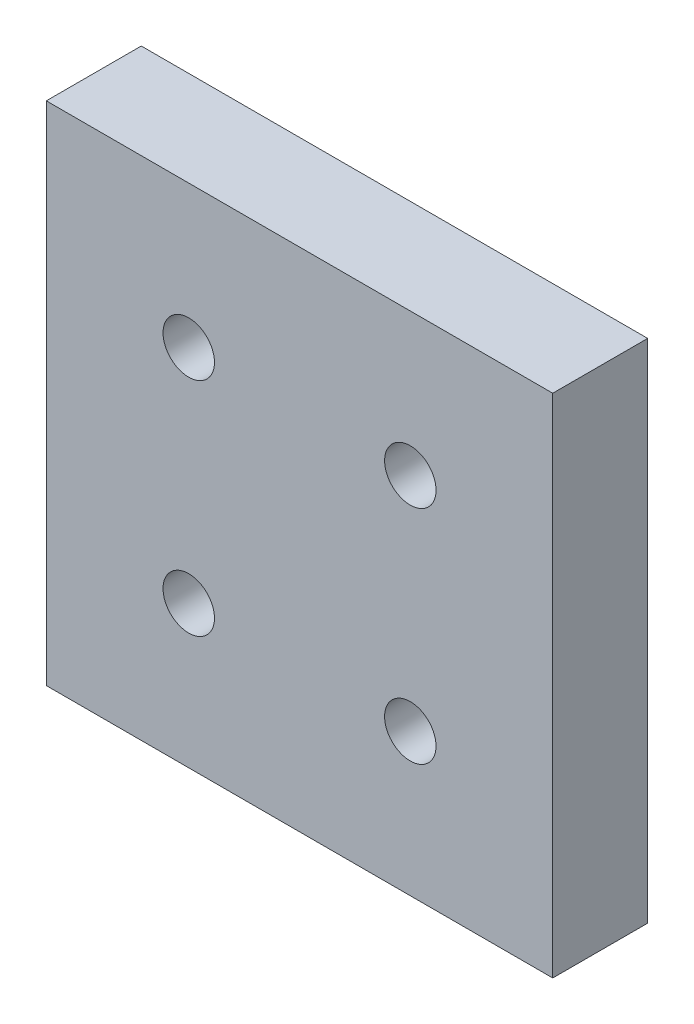
ISO-10303-21;
HEADER;
FILE_DESCRIPTION(('STEP AP214'),'2;1');
FILE_NAME('part.step','',(''),(''),'','','');
FILE_SCHEMA(('AUTOMOTIVE_DESIGN { 1 0 10303 214 1 1 1 1 }'));
ENDSEC;
DATA;
#1=APPLICATION_CONTEXT('core data for automotive mechanical design processes');
#2=APPLICATION_PROTOCOL_DEFINITION('international standard','automotive_design',2000,#1);
#3=PRODUCT_CONTEXT('',#1,'mechanical');
#4=PRODUCT('Part','Part','',(#3));
#5=PRODUCT_RELATED_PRODUCT_CATEGORY('part','',(#4));
#6=PRODUCT_DEFINITION_FORMATION('','',#4);
#7=PRODUCT_DEFINITION_CONTEXT('part definition',#1,'design');
#8=PRODUCT_DEFINITION('design','',#6,#7);
#9=PRODUCT_DEFINITION_SHAPE('','',#8);
#10=(LENGTH_UNIT() NAMED_UNIT(*) SI_UNIT(.MILLI.,.METRE.));
#11=(NAMED_UNIT(*) PLANE_ANGLE_UNIT() SI_UNIT($,.RADIAN.));
#12=(NAMED_UNIT(*) SI_UNIT($,.STERADIAN.) SOLID_ANGLE_UNIT());
#13=UNCERTAINTY_MEASURE_WITH_UNIT(LENGTH_MEASURE(1.E-05),#10,'distance_accuracy_value','');
#14=(GEOMETRIC_REPRESENTATION_CONTEXT(3) GLOBAL_UNCERTAINTY_ASSIGNED_CONTEXT((#13)) GLOBAL_UNIT_ASSIGNED_CONTEXT((#10,
#11,#12)) REPRESENTATION_CONTEXT('',''));
#15=CARTESIAN_POINT('',(0.,0.,0.));
#16=DIRECTION('',(0.,0.,1.));
#17=DIRECTION('',(1.,0.,0.));
#18=AXIS2_PLACEMENT_3D('',#15,#16,#17);
#19=CARTESIAN_POINT('',(-101.6,101.6,38.1));
#20=DIRECTION('',(1.,0.,0.));
#21=DIRECTION('',(0.,1.,0.));
#22=AXIS2_PLACEMENT_3D('',#19,#20,#21);
#23=PLANE('',#22);
#24=DIRECTION('',(0.,-1.,0.));
#25=VECTOR('',#24,1.);
#26=CARTESIAN_POINT('',(-101.6,101.6,0.));
#27=LINE('',#26,#25);
#28=CARTESIAN_POINT('',(-101.6,101.6,0.));
#29=VERTEX_POINT('',#28);
#30=CARTESIAN_POINT('',(-101.6,-101.6,0.));
#31=VERTEX_POINT('',#30);
#32=EDGE_CURVE('E95',#29,#31,#27,.T.);
#33=ORIENTED_EDGE('',*,*,#32,.T.);
#34=DIRECTION('',(0.,0.,-1.));
#35=VECTOR('',#34,1.);
#36=CARTESIAN_POINT('',(-101.6,-101.6,38.1));
#37=LINE('',#36,#35);
#38=CARTESIAN_POINT('',(-101.6,-101.6,38.1));
#39=VERTEX_POINT('',#38);
#40=EDGE_CURVE('E11',#39,#31,#37,.T.);
#41=ORIENTED_EDGE('',*,*,#40,.F.);
#42=DIRECTION('',(0.,-1.,0.));
#43=VECTOR('',#42,1.);
#44=CARTESIAN_POINT('',(-101.6,101.6,38.1));
#45=LINE('',#44,#43);
#46=CARTESIAN_POINT('',(-101.6,101.6,38.1));
#47=VERTEX_POINT('',#46);
#48=EDGE_CURVE('E83',#47,#39,#45,.T.);
#49=ORIENTED_EDGE('',*,*,#48,.F.);
#50=DIRECTION('',(0.,0.,-1.));
#51=VECTOR('',#50,1.);
#52=CARTESIAN_POINT('',(-101.6,101.6,38.1));
#53=LINE('',#52,#51);
#54=EDGE_CURVE('E91',#47,#29,#53,.T.);
#55=ORIENTED_EDGE('',*,*,#54,.T.);
#56=EDGE_LOOP('',(#33,#41,#49,#55));
#57=FACE_BOUND('',#56,.T.);
#58=ADVANCED_FACE('F32',(#57),#23,.F.);
#59=CARTESIAN_POINT('',(-101.6,-101.6,38.1));
#60=DIRECTION('',(0.,1.,0.));
#61=DIRECTION('',(-1.,0.,0.));
#62=AXIS2_PLACEMENT_3D('',#59,#60,#61);
#63=PLANE('',#62);
#64=DIRECTION('',(1.,0.,0.));
#65=VECTOR('',#64,1.);
#66=CARTESIAN_POINT('',(-101.6,-101.6,0.));
#67=LINE('',#66,#65);
#68=CARTESIAN_POINT('',(101.6,-101.6,0.));
#69=VERTEX_POINT('',#68);
#70=EDGE_CURVE('E87',#31,#69,#67,.T.);
#71=ORIENTED_EDGE('',*,*,#70,.T.);
#72=DIRECTION('',(0.,0.,-1.));
#73=VECTOR('',#72,1.);
#74=CARTESIAN_POINT('',(101.6,-101.6,38.1));
#75=LINE('',#74,#73);
#76=CARTESIAN_POINT('',(101.6,-101.6,38.1));
#77=VERTEX_POINT('',#76);
#78=EDGE_CURVE('E40',#77,#69,#75,.T.);
#79=ORIENTED_EDGE('',*,*,#78,.F.);
#80=DIRECTION('',(1.,0.,0.));
#81=VECTOR('',#80,1.);
#82=CARTESIAN_POINT('',(-101.6,-101.6,38.1));
#83=LINE('',#82,#81);
#84=EDGE_CURVE('E78',#39,#77,#83,.T.);
#85=ORIENTED_EDGE('',*,*,#84,.F.);
#86=ORIENTED_EDGE('',*,*,#40,.T.);
#87=EDGE_LOOP('',(#71,#79,#85,#86));
#88=FACE_BOUND('',#87,.T.);
#89=ADVANCED_FACE('F86',(#88),#63,.F.);
#90=CARTESIAN_POINT('',(101.6,101.6,38.1));
#91=DIRECTION('',(-1.,0.,0.));
#92=DIRECTION('',(0.,-1.,0.));
#93=AXIS2_PLACEMENT_3D('',#90,#91,#92);
#94=PLANE('',#93);
#95=DIRECTION('',(0.,1.,0.));
#96=VECTOR('',#95,1.);
#97=CARTESIAN_POINT('',(101.6,101.6,0.));
#98=LINE('',#97,#96);
#99=CARTESIAN_POINT('',(101.6,101.6,0.));
#100=VERTEX_POINT('',#99);
#101=EDGE_CURVE('E65',#69,#100,#98,.T.);
#102=ORIENTED_EDGE('',*,*,#101,.T.);
#103=DIRECTION('',(0.,0.,-1.));
#104=VECTOR('',#103,1.);
#105=CARTESIAN_POINT('',(101.6,101.6,38.1));
#106=LINE('',#105,#104);
#107=CARTESIAN_POINT('',(101.6,101.6,38.1));
#108=VERTEX_POINT('',#107);
#109=EDGE_CURVE('E88',#108,#100,#106,.T.);
#110=ORIENTED_EDGE('',*,*,#109,.F.);
#111=DIRECTION('',(0.,1.,0.));
#112=VECTOR('',#111,1.);
#113=CARTESIAN_POINT('',(101.6,101.6,38.1));
#114=LINE('',#113,#112);
#115=EDGE_CURVE('E81',#77,#108,#114,.T.);
#116=ORIENTED_EDGE('',*,*,#115,.F.);
#117=ORIENTED_EDGE('',*,*,#78,.T.);
#118=EDGE_LOOP('',(#102,#110,#116,#117));
#119=FACE_BOUND('',#118,.T.);
#120=ADVANCED_FACE('F89',(#119),#94,.F.);
#121=CARTESIAN_POINT('',(-101.6,101.6,38.1));
#122=DIRECTION('',(0.,-1.,0.));
#123=DIRECTION('',(0.,0.,-1.));
#124=AXIS2_PLACEMENT_3D('',#121,#122,#123);
#125=PLANE('',#124);
#126=DIRECTION('',(-1.,0.,0.));
#127=VECTOR('',#126,1.);
#128=CARTESIAN_POINT('',(-101.6,101.6,0.));
#129=LINE('',#128,#127);
#130=EDGE_CURVE('E71',#100,#29,#129,.T.);
#131=ORIENTED_EDGE('',*,*,#130,.T.);
#132=ORIENTED_EDGE('',*,*,#54,.F.);
#133=DIRECTION('',(-1.,0.,0.));
#134=VECTOR('',#133,1.);
#135=CARTESIAN_POINT('',(-101.6,101.6,38.1));
#136=LINE('',#135,#134);
#137=EDGE_CURVE('E48',#108,#47,#136,.T.);
#138=ORIENTED_EDGE('',*,*,#137,.F.);
#139=ORIENTED_EDGE('',*,*,#109,.T.);
#140=EDGE_LOOP('',(#131,#132,#138,#139));
#141=FACE_BOUND('',#140,.T.);
#142=ADVANCED_FACE('F103',(#141),#125,.F.);
#143=CARTESIAN_POINT('',(-101.6,-101.6,38.1));
#144=DIRECTION('',(0.,0.,1.));
#145=DIRECTION('',(1.,0.,0.));
#146=AXIS2_PLACEMENT_3D('',#143,#144,#145);
#147=PLANE('',#146);
#148=CARTESIAN_POINT('',(44.45,-44.45,38.1));
#149=DIRECTION('',(0.,0.,1.));
#150=DIRECTION('',(1.,0.,0.));
#151=AXIS2_PLACEMENT_3D('',#148,#149,#150);
#152=CIRCLE('',#151,10.31875);
#153=CARTESIAN_POINT('',(54.76875,-44.45,38.1));
#154=VERTEX_POINT('',#153);
#155=EDGE_CURVE('E153',#154,#154,#152,.T.);
#156=ORIENTED_EDGE('',*,*,#155,.F.);
#157=EDGE_LOOP('',(#156));
#158=FACE_BOUND('',#157,.T.);
#159=CARTESIAN_POINT('',(-44.45,-44.45,38.1));
#160=DIRECTION('',(0.,0.,1.));
#161=DIRECTION('',(1.,0.,0.));
#162=AXIS2_PLACEMENT_3D('',#159,#160,#161);
#163=CIRCLE('',#162,10.31875);
#164=CARTESIAN_POINT('',(-34.13125,-44.45,38.1));
#165=VERTEX_POINT('',#164);
#166=EDGE_CURVE('E141',#165,#165,#163,.T.);
#167=ORIENTED_EDGE('',*,*,#166,.F.);
#168=EDGE_LOOP('',(#167));
#169=FACE_BOUND('',#168,.T.);
#170=CARTESIAN_POINT('',(-44.45,44.45,38.1));
#171=DIRECTION('',(0.,0.,1.));
#172=DIRECTION('',(1.,0.,0.));
#173=AXIS2_PLACEMENT_3D('',#170,#171,#172);
#174=CIRCLE('',#173,10.31875);
#175=CARTESIAN_POINT('',(-34.13125,44.45,38.1));
#176=VERTEX_POINT('',#175);
#177=EDGE_CURVE('E129',#176,#176,#174,.T.);
#178=ORIENTED_EDGE('',*,*,#177,.F.);
#179=EDGE_LOOP('',(#178));
#180=FACE_BOUND('',#179,.T.);
#181=CARTESIAN_POINT('',(44.45,44.45,38.1));
#182=DIRECTION('',(0.,0.,1.));
#183=DIRECTION('',(1.,0.,0.));
#184=AXIS2_PLACEMENT_3D('',#181,#182,#183);
#185=CIRCLE('',#184,10.31875);
#186=CARTESIAN_POINT('',(54.76875,44.45,38.1));
#187=VERTEX_POINT('',#186);
#188=EDGE_CURVE('E117',#187,#187,#185,.T.);
#189=ORIENTED_EDGE('',*,*,#188,.F.);
#190=EDGE_LOOP('',(#189));
#191=FACE_BOUND('',#190,.T.);
#192=ORIENTED_EDGE('',*,*,#48,.T.);
#193=ORIENTED_EDGE('',*,*,#84,.T.);
#194=ORIENTED_EDGE('',*,*,#115,.T.);
#195=ORIENTED_EDGE('',*,*,#137,.T.);
#196=EDGE_LOOP('',(#192,#193,#194,#195));
#197=FACE_BOUND('',#196,.T.);
#198=ADVANCED_FACE('F79',(#158,#169,#180,#191,#197),#147,.T.);
#199=CARTESIAN_POINT('',(-101.6,-101.6,0.));
#200=DIRECTION('',(0.,0.,1.));
#201=DIRECTION('',(1.,0.,0.));
#202=AXIS2_PLACEMENT_3D('',#199,#200,#201);
#203=PLANE('',#202);
#204=CARTESIAN_POINT('',(44.45,-44.45,0.));
#205=DIRECTION('',(0.,0.,1.));
#206=DIRECTION('',(1.,0.,0.));
#207=AXIS2_PLACEMENT_3D('',#204,#205,#206);
#208=CIRCLE('',#207,6.54811999999999);
#209=CARTESIAN_POINT('',(50.99812,-44.45,0.));
#210=VERTEX_POINT('',#209);
#211=EDGE_CURVE('E144',#210,#210,#208,.T.);
#212=ORIENTED_EDGE('',*,*,#211,.T.);
#213=EDGE_LOOP('',(#212));
#214=FACE_BOUND('',#213,.T.);
#215=CARTESIAN_POINT('',(-44.45,-44.45,0.));
#216=DIRECTION('',(0.,0.,1.));
#217=DIRECTION('',(1.,0.,0.));
#218=AXIS2_PLACEMENT_3D('',#215,#216,#217);
#219=CIRCLE('',#218,6.54811999999999);
#220=CARTESIAN_POINT('',(-37.90188,-44.45,0.));
#221=VERTEX_POINT('',#220);
#222=EDGE_CURVE('E132',#221,#221,#219,.T.);
#223=ORIENTED_EDGE('',*,*,#222,.T.);
#224=EDGE_LOOP('',(#223));
#225=FACE_BOUND('',#224,.T.);
#226=CARTESIAN_POINT('',(-44.45,44.45,0.));
#227=DIRECTION('',(0.,0.,1.));
#228=DIRECTION('',(1.,0.,0.));
#229=AXIS2_PLACEMENT_3D('',#226,#227,#228);
#230=CIRCLE('',#229,6.54811999999999);
#231=CARTESIAN_POINT('',(-37.90188,44.45,0.));
#232=VERTEX_POINT('',#231);
#233=EDGE_CURVE('E120',#232,#232,#230,.T.);
#234=ORIENTED_EDGE('',*,*,#233,.T.);
#235=EDGE_LOOP('',(#234));
#236=FACE_BOUND('',#235,.T.);
#237=CARTESIAN_POINT('',(44.45,44.45,0.));
#238=DIRECTION('',(0.,0.,1.));
#239=DIRECTION('',(1.,0.,0.));
#240=AXIS2_PLACEMENT_3D('',#237,#238,#239);
#241=CIRCLE('',#240,6.54811999999999);
#242=CARTESIAN_POINT('',(50.99812,44.45,0.));
#243=VERTEX_POINT('',#242);
#244=EDGE_CURVE('E98',#243,#243,#241,.T.);
#245=ORIENTED_EDGE('',*,*,#244,.T.);
#246=EDGE_LOOP('',(#245));
#247=FACE_BOUND('',#246,.T.);
#248=ORIENTED_EDGE('',*,*,#32,.F.);
#249=ORIENTED_EDGE('',*,*,#130,.F.);
#250=ORIENTED_EDGE('',*,*,#101,.F.);
#251=ORIENTED_EDGE('',*,*,#70,.F.);
#252=EDGE_LOOP('',(#248,#249,#250,#251));
#253=FACE_BOUND('',#252,.T.);
#254=ADVANCED_FACE('F106',(#214,#225,#236,#247,#253),#203,.F.);
#255=CARTESIAN_POINT('',(44.45,44.45,38.1));
#256=DIRECTION('',(0.,0.,1.));
#257=DIRECTION('',(1.,0.,0.));
#258=AXIS2_PLACEMENT_3D('',#255,#256,#257);
#259=CYLINDRICAL_SURFACE('',#258,6.54811999999999);
#260=ORIENTED_EDGE('',*,*,#244,.F.);
#261=EDGE_LOOP('',(#260));
#262=FACE_BOUND('',#261,.T.);
#263=CARTESIAN_POINT('',(44.45,44.45,19.05));
#264=DIRECTION('',(0.,0.,1.));
#265=DIRECTION('',(1.,0.,0.));
#266=AXIS2_PLACEMENT_3D('',#263,#264,#265);
#267=CIRCLE('',#266,6.54812);
#268=CARTESIAN_POINT('',(50.99812,44.45,19.05));
#269=VERTEX_POINT('',#268);
#270=EDGE_CURVE('E111',#269,#269,#267,.T.);
#271=ORIENTED_EDGE('',*,*,#270,.T.);
#272=EDGE_LOOP('',(#271));
#273=FACE_BOUND('',#272,.T.);
#274=ADVANCED_FACE('F181',(#262,#273),#259,.F.);
#275=CARTESIAN_POINT('',(50.99812,44.45,19.05));
#276=DIRECTION('',(0.,0.,-1.));
#277=DIRECTION('',(-1.,0.,0.));
#278=AXIS2_PLACEMENT_3D('',#275,#276,#277);
#279=PLANE('',#278);
#280=ORIENTED_EDGE('',*,*,#270,.F.);
#281=EDGE_LOOP('',(#280));
#282=FACE_BOUND('',#281,.T.);
#283=CARTESIAN_POINT('',(44.45,44.45,19.05));
#284=DIRECTION('',(0.,0.,1.));
#285=DIRECTION('',(1.,0.,0.));
#286=AXIS2_PLACEMENT_3D('',#283,#284,#285);
#287=CIRCLE('',#286,10.31875);
#288=CARTESIAN_POINT('',(54.76875,44.45,19.05));
#289=VERTEX_POINT('',#288);
#290=EDGE_CURVE('E114',#289,#289,#287,.T.);
#291=ORIENTED_EDGE('',*,*,#290,.T.);
#292=EDGE_LOOP('',(#291));
#293=FACE_BOUND('',#292,.T.);
#294=ADVANCED_FACE('F171',(#282,#293),#279,.F.);
#295=CARTESIAN_POINT('',(44.45,44.45,38.1));
#296=DIRECTION('',(0.,0.,1.));
#297=DIRECTION('',(1.,0.,0.));
#298=AXIS2_PLACEMENT_3D('',#295,#296,#297);
#299=CYLINDRICAL_SURFACE('',#298,10.31875);
#300=ORIENTED_EDGE('',*,*,#290,.F.);
#301=EDGE_LOOP('',(#300));
#302=FACE_BOUND('',#301,.T.);
#303=ORIENTED_EDGE('',*,*,#188,.T.);
#304=EDGE_LOOP('',(#303));
#305=FACE_BOUND('',#304,.T.);
#306=ADVANCED_FACE('F168',(#302,#305),#299,.F.);
#307=CARTESIAN_POINT('',(-44.45,44.45,38.1));
#308=DIRECTION('',(0.,0.,1.));
#309=DIRECTION('',(1.,0.,0.));
#310=AXIS2_PLACEMENT_3D('',#307,#308,#309);
#311=CYLINDRICAL_SURFACE('',#310,6.54811999999999);
#312=ORIENTED_EDGE('',*,*,#233,.F.);
#313=EDGE_LOOP('',(#312));
#314=FACE_BOUND('',#313,.T.);
#315=CARTESIAN_POINT('',(-44.45,44.45,19.05));
#316=DIRECTION('',(0.,0.,1.));
#317=DIRECTION('',(1.,0.,0.));
#318=AXIS2_PLACEMENT_3D('',#315,#316,#317);
#319=CIRCLE('',#318,6.54812);
#320=CARTESIAN_POINT('',(-37.90188,44.45,19.05));
#321=VERTEX_POINT('',#320);
#322=EDGE_CURVE('E123',#321,#321,#319,.T.);
#323=ORIENTED_EDGE('',*,*,#322,.T.);
#324=EDGE_LOOP('',(#323));
#325=FACE_BOUND('',#324,.T.);
#326=ADVANCED_FACE('F170',(#314,#325),#311,.F.);
#327=CARTESIAN_POINT('',(-37.90188,44.45,19.05));
#328=DIRECTION('',(0.,0.,-1.));
#329=DIRECTION('',(-1.,0.,0.));
#330=AXIS2_PLACEMENT_3D('',#327,#328,#329);
#331=PLANE('',#330);
#332=ORIENTED_EDGE('',*,*,#322,.F.);
#333=EDGE_LOOP('',(#332));
#334=FACE_BOUND('',#333,.T.);
#335=CARTESIAN_POINT('',(-44.45,44.45,19.05));
#336=DIRECTION('',(0.,0.,1.));
#337=DIRECTION('',(1.,0.,0.));
#338=AXIS2_PLACEMENT_3D('',#335,#336,#337);
#339=CIRCLE('',#338,10.31875);
#340=CARTESIAN_POINT('',(-34.13125,44.45,19.05));
#341=VERTEX_POINT('',#340);
#342=EDGE_CURVE('E126',#341,#341,#339,.T.);
#343=ORIENTED_EDGE('',*,*,#342,.T.);
#344=EDGE_LOOP('',(#343));
#345=FACE_BOUND('',#344,.T.);
#346=ADVANCED_FACE('F178',(#334,#345),#331,.F.);
#347=CARTESIAN_POINT('',(-44.45,44.45,38.1));
#348=DIRECTION('',(0.,0.,1.));
#349=DIRECTION('',(1.,0.,0.));
#350=AXIS2_PLACEMENT_3D('',#347,#348,#349);
#351=CYLINDRICAL_SURFACE('',#350,10.31875);
#352=ORIENTED_EDGE('',*,*,#342,.F.);
#353=EDGE_LOOP('',(#352));
#354=FACE_BOUND('',#353,.T.);
#355=ORIENTED_EDGE('',*,*,#177,.T.);
#356=EDGE_LOOP('',(#355));
#357=FACE_BOUND('',#356,.T.);
#358=ADVANCED_FACE('F233',(#354,#357),#351,.F.);
#359=CARTESIAN_POINT('',(-44.45,-44.45,38.1));
#360=DIRECTION('',(0.,0.,1.));
#361=DIRECTION('',(1.,0.,0.));
#362=AXIS2_PLACEMENT_3D('',#359,#360,#361);
#363=CYLINDRICAL_SURFACE('',#362,6.54811999999999);
#364=ORIENTED_EDGE('',*,*,#222,.F.);
#365=EDGE_LOOP('',(#364));
#366=FACE_BOUND('',#365,.T.);
#367=CARTESIAN_POINT('',(-44.45,-44.45,19.05));
#368=DIRECTION('',(0.,0.,1.));
#369=DIRECTION('',(1.,0.,0.));
#370=AXIS2_PLACEMENT_3D('',#367,#368,#369);
#371=CIRCLE('',#370,6.54812);
#372=CARTESIAN_POINT('',(-37.90188,-44.45,19.05));
#373=VERTEX_POINT('',#372);
#374=EDGE_CURVE('E135',#373,#373,#371,.T.);
#375=ORIENTED_EDGE('',*,*,#374,.T.);
#376=EDGE_LOOP('',(#375));
#377=FACE_BOUND('',#376,.T.);
#378=ADVANCED_FACE('F243',(#366,#377),#363,.F.);
#379=CARTESIAN_POINT('',(-37.90188,-44.45,19.05));
#380=DIRECTION('',(0.,0.,-1.));
#381=DIRECTION('',(-1.,0.,0.));
#382=AXIS2_PLACEMENT_3D('',#379,#380,#381);
#383=PLANE('',#382);
#384=ORIENTED_EDGE('',*,*,#374,.F.);
#385=EDGE_LOOP('',(#384));
#386=FACE_BOUND('',#385,.T.);
#387=CARTESIAN_POINT('',(-44.45,-44.45,19.05));
#388=DIRECTION('',(0.,0.,1.));
#389=DIRECTION('',(1.,0.,0.));
#390=AXIS2_PLACEMENT_3D('',#387,#388,#389);
#391=CIRCLE('',#390,10.31875);
#392=CARTESIAN_POINT('',(-34.13125,-44.45,19.05));
#393=VERTEX_POINT('',#392);
#394=EDGE_CURVE('E138',#393,#393,#391,.T.);
#395=ORIENTED_EDGE('',*,*,#394,.T.);
#396=EDGE_LOOP('',(#395));
#397=FACE_BOUND('',#396,.T.);
#398=ADVANCED_FACE('F253',(#386,#397),#383,.F.);
#399=CARTESIAN_POINT('',(-44.45,-44.45,38.1));
#400=DIRECTION('',(0.,0.,1.));
#401=DIRECTION('',(1.,0.,0.));
#402=AXIS2_PLACEMENT_3D('',#399,#400,#401);
#403=CYLINDRICAL_SURFACE('',#402,10.31875);
#404=ORIENTED_EDGE('',*,*,#394,.F.);
#405=EDGE_LOOP('',(#404));
#406=FACE_BOUND('',#405,.T.);
#407=ORIENTED_EDGE('',*,*,#166,.T.);
#408=EDGE_LOOP('',(#407));
#409=FACE_BOUND('',#408,.T.);
#410=ADVANCED_FACE('F263',(#406,#409),#403,.F.);
#411=CARTESIAN_POINT('',(44.45,-44.45,38.1));
#412=DIRECTION('',(0.,0.,1.));
#413=DIRECTION('',(1.,0.,0.));
#414=AXIS2_PLACEMENT_3D('',#411,#412,#413);
#415=CYLINDRICAL_SURFACE('',#414,6.54811999999999);
#416=ORIENTED_EDGE('',*,*,#211,.F.);
#417=EDGE_LOOP('',(#416));
#418=FACE_BOUND('',#417,.T.);
#419=CARTESIAN_POINT('',(44.45,-44.45,19.05));
#420=DIRECTION('',(0.,0.,1.));
#421=DIRECTION('',(1.,0.,0.));
#422=AXIS2_PLACEMENT_3D('',#419,#420,#421);
#423=CIRCLE('',#422,6.54812);
#424=CARTESIAN_POINT('',(50.99812,-44.45,19.05));
#425=VERTEX_POINT('',#424);
#426=EDGE_CURVE('E147',#425,#425,#423,.T.);
#427=ORIENTED_EDGE('',*,*,#426,.T.);
#428=EDGE_LOOP('',(#427));
#429=FACE_BOUND('',#428,.T.);
#430=ADVANCED_FACE('F273',(#418,#429),#415,.F.);
#431=CARTESIAN_POINT('',(50.99812,-44.45,19.05));
#432=DIRECTION('',(0.,0.,-1.));
#433=DIRECTION('',(-1.,0.,0.));
#434=AXIS2_PLACEMENT_3D('',#431,#432,#433);
#435=PLANE('',#434);
#436=ORIENTED_EDGE('',*,*,#426,.F.);
#437=EDGE_LOOP('',(#436));
#438=FACE_BOUND('',#437,.T.);
#439=CARTESIAN_POINT('',(44.45,-44.45,19.05));
#440=DIRECTION('',(0.,0.,1.));
#441=DIRECTION('',(1.,0.,0.));
#442=AXIS2_PLACEMENT_3D('',#439,#440,#441);
#443=CIRCLE('',#442,10.31875);
#444=CARTESIAN_POINT('',(54.76875,-44.45,19.05));
#445=VERTEX_POINT('',#444);
#446=EDGE_CURVE('E150',#445,#445,#443,.T.);
#447=ORIENTED_EDGE('',*,*,#446,.T.);
#448=EDGE_LOOP('',(#447));
#449=FACE_BOUND('',#448,.T.);
#450=ADVANCED_FACE('F283',(#438,#449),#435,.F.);
#451=CARTESIAN_POINT('',(44.45,-44.45,38.1));
#452=DIRECTION('',(0.,0.,1.));
#453=DIRECTION('',(1.,0.,0.));
#454=AXIS2_PLACEMENT_3D('',#451,#452,#453);
#455=CYLINDRICAL_SURFACE('',#454,10.31875);
#456=ORIENTED_EDGE('',*,*,#446,.F.);
#457=EDGE_LOOP('',(#456));
#458=FACE_BOUND('',#457,.T.);
#459=ORIENTED_EDGE('',*,*,#155,.T.);
#460=EDGE_LOOP('',(#459));
#461=FACE_BOUND('',#460,.T.);
#462=ADVANCED_FACE('F157',(#458,#461),#455,.F.);
#463=CLOSED_SHELL('',(#58,#89,#120,#142,#198,#254,#274,#294,#306,#326,#346,#358,#378,#398,#410,
#430,#450,#462));
#464=MANIFOLD_SOLID_BREP('B2',#463);
#465=ADVANCED_BREP_SHAPE_REPRESENTATION('',(#18,#464),#14);
#466=SHAPE_DEFINITION_REPRESENTATION(#9,#465);
ENDSEC;
END-ISO-10303-21;
